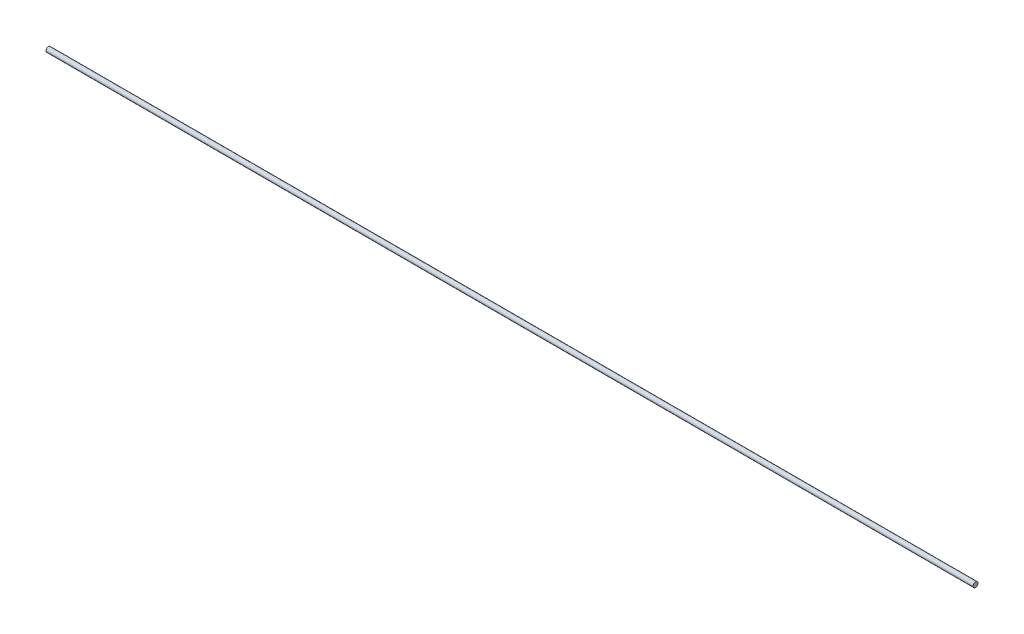
ISO-10303-21;
HEADER;
FILE_DESCRIPTION(('STEP AP214'),'2;1');
FILE_NAME('part.step','',(''),(''),'','','');
FILE_SCHEMA(('AUTOMOTIVE_DESIGN { 1 0 10303 214 1 1 1 1 }'));
ENDSEC;
DATA;
#1=APPLICATION_CONTEXT('core data for automotive mechanical design processes');
#2=APPLICATION_PROTOCOL_DEFINITION('international standard','automotive_design',2000,#1);
#3=PRODUCT_CONTEXT('',#1,'mechanical');
#4=PRODUCT('Part','Part','',(#3));
#5=PRODUCT_RELATED_PRODUCT_CATEGORY('part','',(#4));
#6=PRODUCT_DEFINITION_FORMATION('','',#4);
#7=PRODUCT_DEFINITION_CONTEXT('part definition',#1,'design');
#8=PRODUCT_DEFINITION('design','',#6,#7);
#9=PRODUCT_DEFINITION_SHAPE('','',#8);
#10=(LENGTH_UNIT() NAMED_UNIT(*) SI_UNIT(.MILLI.,.METRE.));
#11=(NAMED_UNIT(*) PLANE_ANGLE_UNIT() SI_UNIT($,.RADIAN.));
#12=(NAMED_UNIT(*) SI_UNIT($,.STERADIAN.) SOLID_ANGLE_UNIT());
#13=UNCERTAINTY_MEASURE_WITH_UNIT(LENGTH_MEASURE(1.E-05),#10,'distance_accuracy_value','');
#14=(GEOMETRIC_REPRESENTATION_CONTEXT(3) GLOBAL_UNCERTAINTY_ASSIGNED_CONTEXT((#13)) GLOBAL_UNIT_ASSIGNED_CONTEXT((#10,
#11,#12)) REPRESENTATION_CONTEXT('',''));
#15=CARTESIAN_POINT('',(0.,0.,0.));
#16=DIRECTION('',(0.,0.,1.));
#17=DIRECTION('',(1.,0.,0.));
#18=AXIS2_PLACEMENT_3D('',#15,#16,#17);
#19=CARTESIAN_POINT('',(380.,0.,0.));
#20=DIRECTION('',(-1.,0.,0.));
#21=DIRECTION('',(0.,0.,1.));
#22=AXIS2_PLACEMENT_3D('',#19,#20,#21);
#23=CYLINDRICAL_SURFACE('',#22,1.);
#24=CARTESIAN_POINT('',(380.,0.,0.));
#25=DIRECTION('',(1.,0.,0.));
#26=DIRECTION('',(0.,0.,-1.));
#27=AXIS2_PLACEMENT_3D('',#24,#25,#26);
#28=CIRCLE('',#27,1.);
#29=CARTESIAN_POINT('',(380.,0.,-1.));
#30=VERTEX_POINT('',#29);
#31=EDGE_CURVE('E10',#30,#30,#28,.T.);
#32=ORIENTED_EDGE('',*,*,#31,.F.);
#33=EDGE_LOOP('',(#32));
#34=FACE_BOUND('',#33,.T.);
#35=CARTESIAN_POINT('',(0.,0.,0.));
#36=DIRECTION('',(1.,0.,0.));
#37=DIRECTION('',(0.,0.,-1.));
#38=AXIS2_PLACEMENT_3D('',#35,#36,#37);
#39=CIRCLE('',#38,1.);
#40=CARTESIAN_POINT('',(0.,0.,-1.));
#41=VERTEX_POINT('',#40);
#42=EDGE_CURVE('E38',#41,#41,#39,.T.);
#43=ORIENTED_EDGE('',*,*,#42,.T.);
#44=EDGE_LOOP('',(#43));
#45=FACE_BOUND('',#44,.T.);
#46=ADVANCED_FACE('F35',(#34,#45),#23,.T.);
#47=CARTESIAN_POINT('',(380.,0.,0.));
#48=DIRECTION('',(1.,0.,0.));
#49=DIRECTION('',(0.,0.,-1.));
#50=AXIS2_PLACEMENT_3D('',#47,#48,#49);
#51=PLANE('',#50);
#52=ORIENTED_EDGE('',*,*,#31,.T.);
#53=EDGE_LOOP('',(#52));
#54=FACE_BOUND('',#53,.T.);
#55=ADVANCED_FACE('F50',(#54),#51,.T.);
#56=CARTESIAN_POINT('',(0.,0.,0.));
#57=DIRECTION('',(1.,0.,0.));
#58=DIRECTION('',(0.,0.,-1.));
#59=AXIS2_PLACEMENT_3D('',#56,#57,#58);
#60=PLANE('',#59);
#61=ORIENTED_EDGE('',*,*,#42,.F.);
#62=EDGE_LOOP('',(#61));
#63=FACE_BOUND('',#62,.T.);
#64=ADVANCED_FACE('F48',(#63),#60,.F.);
#65=CLOSED_SHELL('',(#46,#55,#64));
#66=MANIFOLD_SOLID_BREP('B2',#65);
#67=ADVANCED_BREP_SHAPE_REPRESENTATION('',(#18,#66),#14);
#68=SHAPE_DEFINITION_REPRESENTATION(#9,#67);
ENDSEC;
END-ISO-10303-21;
